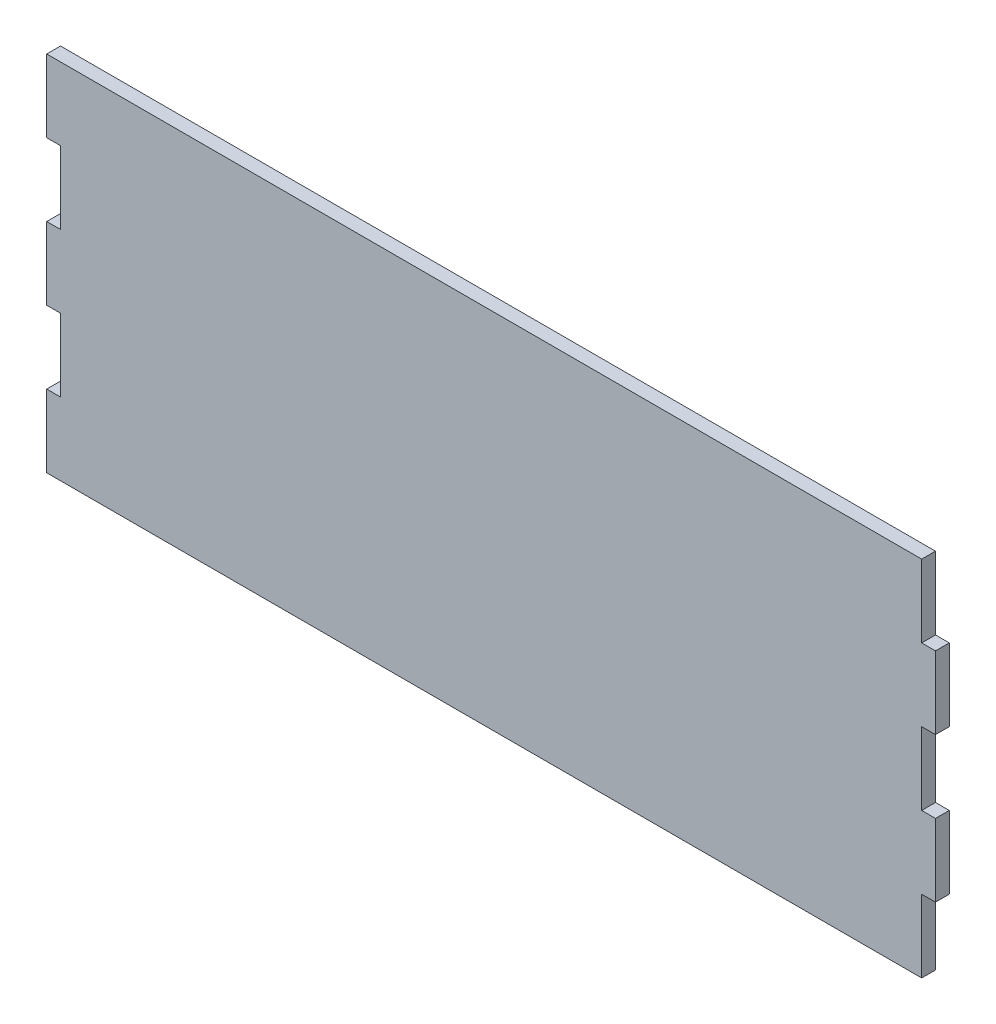
ISO-10303-21;
HEADER;
FILE_DESCRIPTION(('STEP AP214'),'2;1');
FILE_NAME('part.step','',(''),(''),'','','');
FILE_SCHEMA(('AUTOMOTIVE_DESIGN { 1 0 10303 214 1 1 1 1 }'));
ENDSEC;
DATA;
#1=APPLICATION_CONTEXT('core data for automotive mechanical design processes');
#2=APPLICATION_PROTOCOL_DEFINITION('international standard','automotive_design',2000,#1);
#3=PRODUCT_CONTEXT('',#1,'mechanical');
#4=PRODUCT('Part','Part','',(#3));
#5=PRODUCT_RELATED_PRODUCT_CATEGORY('part','',(#4));
#6=PRODUCT_DEFINITION_FORMATION('','',#4);
#7=PRODUCT_DEFINITION_CONTEXT('part definition',#1,'design');
#8=PRODUCT_DEFINITION('design','',#6,#7);
#9=PRODUCT_DEFINITION_SHAPE('','',#8);
#10=(LENGTH_UNIT() NAMED_UNIT(*) SI_UNIT(.MILLI.,.METRE.));
#11=(NAMED_UNIT(*) PLANE_ANGLE_UNIT() SI_UNIT($,.RADIAN.));
#12=(NAMED_UNIT(*) SI_UNIT($,.STERADIAN.) SOLID_ANGLE_UNIT());
#13=UNCERTAINTY_MEASURE_WITH_UNIT(LENGTH_MEASURE(1.E-05),#10,'distance_accuracy_value','');
#14=(GEOMETRIC_REPRESENTATION_CONTEXT(3) GLOBAL_UNCERTAINTY_ASSIGNED_CONTEXT((#13)) GLOBAL_UNIT_ASSIGNED_CONTEXT((#10,
#11,#12)) REPRESENTATION_CONTEXT('',''));
#15=CARTESIAN_POINT('',(0.,0.,0.));
#16=DIRECTION('',(0.,0.,1.));
#17=DIRECTION('',(1.,0.,0.));
#18=AXIS2_PLACEMENT_3D('',#15,#16,#17);
#19=CARTESIAN_POINT('',(311.15,127.,4.826));
#20=DIRECTION('',(1.,0.,0.));
#21=DIRECTION('',(0.,0.,-1.));
#22=AXIS2_PLACEMENT_3D('',#19,#20,#21);
#23=PLANE('',#22);
#24=DIRECTION('',(0.,-1.,0.));
#25=VECTOR('',#24,1.);
#26=CARTESIAN_POINT('',(311.15,127.,0.));
#27=LINE('',#26,#25);
#28=CARTESIAN_POINT('',(311.15,127.,0.));
#29=VERTEX_POINT('',#28);
#30=CARTESIAN_POINT('',(311.15,101.6,0.));
#31=VERTEX_POINT('',#30);
#32=EDGE_CURVE('E201',#29,#31,#27,.T.);
#33=ORIENTED_EDGE('',*,*,#32,.T.);
#34=DIRECTION('',(0.,0.,-1.));
#35=VECTOR('',#34,1.);
#36=CARTESIAN_POINT('',(311.15,101.6,4.826));
#37=LINE('',#36,#35);
#38=CARTESIAN_POINT('',(311.15,101.6,4.826));
#39=VERTEX_POINT('',#38);
#40=EDGE_CURVE('E11',#39,#31,#37,.T.);
#41=ORIENTED_EDGE('',*,*,#40,.F.);
#42=DIRECTION('',(0.,-1.,0.));
#43=VECTOR('',#42,1.);
#44=CARTESIAN_POINT('',(311.15,127.,4.826));
#45=LINE('',#44,#43);
#46=CARTESIAN_POINT('',(311.15,127.,4.826));
#47=VERTEX_POINT('',#46);
#48=EDGE_CURVE('E239',#47,#39,#45,.T.);
#49=ORIENTED_EDGE('',*,*,#48,.F.);
#50=DIRECTION('',(0.,0.,-1.));
#51=VECTOR('',#50,1.);
#52=CARTESIAN_POINT('',(311.15,127.,4.826));
#53=LINE('',#52,#51);
#54=EDGE_CURVE('E197',#47,#29,#53,.T.);
#55=ORIENTED_EDGE('',*,*,#54,.T.);
#56=EDGE_LOOP('',(#33,#41,#49,#55));
#57=FACE_BOUND('',#56,.T.);
#58=ADVANCED_FACE('F33',(#57),#23,.F.);
#59=CARTESIAN_POINT('',(311.15,101.6,4.826));
#60=DIRECTION('',(0.,1.,0.));
#61=DIRECTION('',(0.,0.,1.));
#62=AXIS2_PLACEMENT_3D('',#59,#60,#61);
#63=PLANE('',#62);
#64=DIRECTION('',(1.,0.,0.));
#65=VECTOR('',#64,1.);
#66=CARTESIAN_POINT('',(311.15,101.6,0.));
#67=LINE('',#66,#65);
#68=CARTESIAN_POINT('',(315.976,101.6,0.));
#69=VERTEX_POINT('',#68);
#70=EDGE_CURVE('E204',#31,#69,#67,.T.);
#71=ORIENTED_EDGE('',*,*,#70,.T.);
#72=DIRECTION('',(0.,0.,-1.));
#73=VECTOR('',#72,1.);
#74=CARTESIAN_POINT('',(315.976,101.6,4.826));
#75=LINE('',#74,#73);
#76=CARTESIAN_POINT('',(315.976,101.6,4.826));
#77=VERTEX_POINT('',#76);
#78=EDGE_CURVE('E41',#77,#69,#75,.T.);
#79=ORIENTED_EDGE('',*,*,#78,.F.);
#80=DIRECTION('',(1.,0.,0.));
#81=VECTOR('',#80,1.);
#82=CARTESIAN_POINT('',(311.15,101.6,4.826));
#83=LINE('',#82,#81);
#84=EDGE_CURVE('E128',#39,#77,#83,.T.);
#85=ORIENTED_EDGE('',*,*,#84,.F.);
#86=ORIENTED_EDGE('',*,*,#40,.T.);
#87=EDGE_LOOP('',(#71,#79,#85,#86));
#88=FACE_BOUND('',#87,.T.);
#89=ADVANCED_FACE('F357',(#88),#63,.F.);
#90=CARTESIAN_POINT('',(315.976,101.6,4.826));
#91=DIRECTION('',(1.,0.,0.));
#92=DIRECTION('',(0.,0.,-1.));
#93=AXIS2_PLACEMENT_3D('',#90,#91,#92);
#94=PLANE('',#93);
#95=DIRECTION('',(0.,-1.,0.));
#96=VECTOR('',#95,1.);
#97=CARTESIAN_POINT('',(315.976,101.6,0.));
#98=LINE('',#97,#96);
#99=CARTESIAN_POINT('',(315.976,76.2,0.));
#100=VERTEX_POINT('',#99);
#101=EDGE_CURVE('E206',#69,#100,#98,.T.);
#102=ORIENTED_EDGE('',*,*,#101,.T.);
#103=DIRECTION('',(0.,0.,-1.));
#104=VECTOR('',#103,1.);
#105=CARTESIAN_POINT('',(315.976,76.2,4.826));
#106=LINE('',#105,#104);
#107=CARTESIAN_POINT('',(315.976,76.2,4.826));
#108=VERTEX_POINT('',#107);
#109=EDGE_CURVE('E282',#108,#100,#106,.T.);
#110=ORIENTED_EDGE('',*,*,#109,.F.);
#111=DIRECTION('',(0.,-1.,0.));
#112=VECTOR('',#111,1.);
#113=CARTESIAN_POINT('',(315.976,101.6,4.826));
#114=LINE('',#113,#112);
#115=EDGE_CURVE('E290',#77,#108,#114,.T.);
#116=ORIENTED_EDGE('',*,*,#115,.F.);
#117=ORIENTED_EDGE('',*,*,#78,.T.);
#118=EDGE_LOOP('',(#102,#110,#116,#117));
#119=FACE_BOUND('',#118,.T.);
#120=ADVANCED_FACE('F288',(#119),#94,.F.);
#121=CARTESIAN_POINT('',(311.15,76.2,4.826));
#122=DIRECTION('',(0.,-1.,0.));
#123=DIRECTION('',(1.,0.,0.));
#124=AXIS2_PLACEMENT_3D('',#121,#122,#123);
#125=PLANE('',#124);
#126=DIRECTION('',(-1.,0.,0.));
#127=VECTOR('',#126,1.);
#128=CARTESIAN_POINT('',(311.15,76.2,0.));
#129=LINE('',#128,#127);
#130=CARTESIAN_POINT('',(311.15,76.2,0.));
#131=VERTEX_POINT('',#130);
#132=EDGE_CURVE('E208',#100,#131,#129,.T.);
#133=ORIENTED_EDGE('',*,*,#132,.T.);
#134=DIRECTION('',(0.,0.,-1.));
#135=VECTOR('',#134,1.);
#136=CARTESIAN_POINT('',(311.15,76.2,4.826));
#137=LINE('',#136,#135);
#138=CARTESIAN_POINT('',(311.15,76.2,4.826));
#139=VERTEX_POINT('',#138);
#140=EDGE_CURVE('E279',#139,#131,#137,.T.);
#141=ORIENTED_EDGE('',*,*,#140,.F.);
#142=DIRECTION('',(-1.,0.,0.));
#143=VECTOR('',#142,1.);
#144=CARTESIAN_POINT('',(311.15,76.2,4.826));
#145=LINE('',#144,#143);
#146=EDGE_CURVE('E308',#108,#139,#145,.T.);
#147=ORIENTED_EDGE('',*,*,#146,.F.);
#148=ORIENTED_EDGE('',*,*,#109,.T.);
#149=EDGE_LOOP('',(#133,#141,#147,#148));
#150=FACE_BOUND('',#149,.T.);
#151=ADVANCED_FACE('F299',(#150),#125,.F.);
#152=CARTESIAN_POINT('',(311.15,76.2,4.826));
#153=DIRECTION('',(1.,0.,0.));
#154=DIRECTION('',(0.,0.,-1.));
#155=AXIS2_PLACEMENT_3D('',#152,#153,#154);
#156=PLANE('',#155);
#157=DIRECTION('',(0.,-1.,0.));
#158=VECTOR('',#157,1.);
#159=CARTESIAN_POINT('',(311.15,76.2,0.));
#160=LINE('',#159,#158);
#161=CARTESIAN_POINT('',(311.15,50.8,0.));
#162=VERTEX_POINT('',#161);
#163=EDGE_CURVE('E210',#131,#162,#160,.T.);
#164=ORIENTED_EDGE('',*,*,#163,.T.);
#165=DIRECTION('',(0.,0.,-1.));
#166=VECTOR('',#165,1.);
#167=CARTESIAN_POINT('',(311.15,50.8,4.826));
#168=LINE('',#167,#166);
#169=CARTESIAN_POINT('',(311.15,50.8,4.826));
#170=VERTEX_POINT('',#169);
#171=EDGE_CURVE('E276',#170,#162,#168,.T.);
#172=ORIENTED_EDGE('',*,*,#171,.F.);
#173=DIRECTION('',(0.,-1.,0.));
#174=VECTOR('',#173,1.);
#175=CARTESIAN_POINT('',(311.15,76.2,4.826));
#176=LINE('',#175,#174);
#177=EDGE_CURVE('E305',#139,#170,#176,.T.);
#178=ORIENTED_EDGE('',*,*,#177,.F.);
#179=ORIENTED_EDGE('',*,*,#140,.T.);
#180=EDGE_LOOP('',(#164,#172,#178,#179));
#181=FACE_BOUND('',#180,.T.);
#182=ADVANCED_FACE('F303',(#181),#156,.F.);
#183=CARTESIAN_POINT('',(311.15,50.8,4.826));
#184=DIRECTION('',(0.,1.,0.));
#185=DIRECTION('',(0.,0.,1.));
#186=AXIS2_PLACEMENT_3D('',#183,#184,#185);
#187=PLANE('',#186);
#188=DIRECTION('',(1.,0.,0.));
#189=VECTOR('',#188,1.);
#190=CARTESIAN_POINT('',(311.15,50.8,0.));
#191=LINE('',#190,#189);
#192=CARTESIAN_POINT('',(315.976,50.8,0.));
#193=VERTEX_POINT('',#192);
#194=EDGE_CURVE('E212',#162,#193,#191,.T.);
#195=ORIENTED_EDGE('',*,*,#194,.T.);
#196=DIRECTION('',(0.,0.,-1.));
#197=VECTOR('',#196,1.);
#198=CARTESIAN_POINT('',(315.976,50.8,4.826));
#199=LINE('',#198,#197);
#200=CARTESIAN_POINT('',(315.976,50.8,4.826));
#201=VERTEX_POINT('',#200);
#202=EDGE_CURVE('E273',#201,#193,#199,.T.);
#203=ORIENTED_EDGE('',*,*,#202,.F.);
#204=DIRECTION('',(1.,0.,0.));
#205=VECTOR('',#204,1.);
#206=CARTESIAN_POINT('',(311.15,50.8,4.826));
#207=LINE('',#206,#205);
#208=EDGE_CURVE('E307',#170,#201,#207,.T.);
#209=ORIENTED_EDGE('',*,*,#208,.F.);
#210=ORIENTED_EDGE('',*,*,#171,.T.);
#211=EDGE_LOOP('',(#195,#203,#209,#210));
#212=FACE_BOUND('',#211,.T.);
#213=ADVANCED_FACE('F370',(#212),#187,.F.);
#214=CARTESIAN_POINT('',(315.976,50.8,4.826));
#215=DIRECTION('',(1.,0.,0.));
#216=DIRECTION('',(0.,0.,-1.));
#217=AXIS2_PLACEMENT_3D('',#214,#215,#216);
#218=PLANE('',#217);
#219=DIRECTION('',(0.,-1.,0.));
#220=VECTOR('',#219,1.);
#221=CARTESIAN_POINT('',(315.976,50.8,0.));
#222=LINE('',#221,#220);
#223=CARTESIAN_POINT('',(315.976,25.4,0.));
#224=VERTEX_POINT('',#223);
#225=EDGE_CURVE('E214',#193,#224,#222,.T.);
#226=ORIENTED_EDGE('',*,*,#225,.T.);
#227=DIRECTION('',(0.,0.,-1.));
#228=VECTOR('',#227,1.);
#229=CARTESIAN_POINT('',(315.976,25.4,4.826));
#230=LINE('',#229,#228);
#231=CARTESIAN_POINT('',(315.976,25.4,4.826));
#232=VERTEX_POINT('',#231);
#233=EDGE_CURVE('E270',#232,#224,#230,.T.);
#234=ORIENTED_EDGE('',*,*,#233,.F.);
#235=DIRECTION('',(0.,-1.,0.));
#236=VECTOR('',#235,1.);
#237=CARTESIAN_POINT('',(315.976,50.8,4.826));
#238=LINE('',#237,#236);
#239=EDGE_CURVE('E310',#201,#232,#238,.T.);
#240=ORIENTED_EDGE('',*,*,#239,.F.);
#241=ORIENTED_EDGE('',*,*,#202,.T.);
#242=EDGE_LOOP('',(#226,#234,#240,#241));
#243=FACE_BOUND('',#242,.T.);
#244=ADVANCED_FACE('F373',(#243),#218,.F.);
#245=CARTESIAN_POINT('',(311.15,25.4,4.826));
#246=DIRECTION('',(0.,-1.,0.));
#247=DIRECTION('',(1.,0.,0.));
#248=AXIS2_PLACEMENT_3D('',#245,#246,#247);
#249=PLANE('',#248);
#250=DIRECTION('',(-1.,0.,0.));
#251=VECTOR('',#250,1.);
#252=CARTESIAN_POINT('',(311.15,25.4,0.));
#253=LINE('',#252,#251);
#254=CARTESIAN_POINT('',(311.15,25.4,0.));
#255=VERTEX_POINT('',#254);
#256=EDGE_CURVE('E216',#224,#255,#253,.T.);
#257=ORIENTED_EDGE('',*,*,#256,.T.);
#258=DIRECTION('',(0.,0.,-1.));
#259=VECTOR('',#258,1.);
#260=CARTESIAN_POINT('',(311.15,25.4,4.826));
#261=LINE('',#260,#259);
#262=CARTESIAN_POINT('',(311.15,25.4,4.826));
#263=VERTEX_POINT('',#262);
#264=EDGE_CURVE('E267',#263,#255,#261,.T.);
#265=ORIENTED_EDGE('',*,*,#264,.F.);
#266=DIRECTION('',(-1.,0.,0.));
#267=VECTOR('',#266,1.);
#268=CARTESIAN_POINT('',(311.15,25.4,4.826));
#269=LINE('',#268,#267);
#270=EDGE_CURVE('E316',#232,#263,#269,.T.);
#271=ORIENTED_EDGE('',*,*,#270,.F.);
#272=ORIENTED_EDGE('',*,*,#233,.T.);
#273=EDGE_LOOP('',(#257,#265,#271,#272));
#274=FACE_BOUND('',#273,.T.);
#275=ADVANCED_FACE('F377',(#274),#249,.F.);
#276=CARTESIAN_POINT('',(311.15,25.4,4.826));
#277=DIRECTION('',(1.,0.,0.));
#278=DIRECTION('',(0.,0.,-1.));
#279=AXIS2_PLACEMENT_3D('',#276,#277,#278);
#280=PLANE('',#279);
#281=DIRECTION('',(0.,-1.,0.));
#282=VECTOR('',#281,1.);
#283=CARTESIAN_POINT('',(311.15,25.4,0.));
#284=LINE('',#283,#282);
#285=CARTESIAN_POINT('',(311.15,0.,0.));
#286=VERTEX_POINT('',#285);
#287=EDGE_CURVE('E218',#255,#286,#284,.T.);
#288=ORIENTED_EDGE('',*,*,#287,.T.);
#289=DIRECTION('',(0.,0.,-1.));
#290=VECTOR('',#289,1.);
#291=CARTESIAN_POINT('',(311.15,0.,4.826));
#292=LINE('',#291,#290);
#293=CARTESIAN_POINT('',(311.15,0.,4.826));
#294=VERTEX_POINT('',#293);
#295=EDGE_CURVE('E264',#294,#286,#292,.T.);
#296=ORIENTED_EDGE('',*,*,#295,.F.);
#297=DIRECTION('',(0.,-1.,0.));
#298=VECTOR('',#297,1.);
#299=CARTESIAN_POINT('',(311.15,25.4,4.826));
#300=LINE('',#299,#298);
#301=EDGE_CURVE('E318',#263,#294,#300,.T.);
#302=ORIENTED_EDGE('',*,*,#301,.F.);
#303=ORIENTED_EDGE('',*,*,#264,.T.);
#304=EDGE_LOOP('',(#288,#296,#302,#303));
#305=FACE_BOUND('',#304,.T.);
#306=ADVANCED_FACE('F381',(#305),#280,.F.);
#307=CARTESIAN_POINT('',(311.15,0.,4.826));
#308=DIRECTION('',(0.,1.,0.));
#309=DIRECTION('',(0.,0.,1.));
#310=AXIS2_PLACEMENT_3D('',#307,#308,#309);
#311=PLANE('',#310);
#312=DIRECTION('',(1.,0.,0.));
#313=VECTOR('',#312,1.);
#314=CARTESIAN_POINT('',(311.15,0.,0.));
#315=LINE('',#314,#313);
#316=CARTESIAN_POINT('',(617.474,0.,0.));
#317=VERTEX_POINT('',#316);
#318=EDGE_CURVE('E220',#286,#317,#315,.T.);
#319=ORIENTED_EDGE('',*,*,#318,.T.);
#320=DIRECTION('',(0.,0.,-1.));
#321=VECTOR('',#320,1.);
#322=CARTESIAN_POINT('',(617.474,0.,4.826));
#323=LINE('',#322,#321);
#324=CARTESIAN_POINT('',(617.474,0.,4.826));
#325=VERTEX_POINT('',#324);
#326=EDGE_CURVE('E261',#325,#317,#323,.T.);
#327=ORIENTED_EDGE('',*,*,#326,.F.);
#328=DIRECTION('',(1.,0.,0.));
#329=VECTOR('',#328,1.);
#330=CARTESIAN_POINT('',(311.15,0.,4.826));
#331=LINE('',#330,#329);
#332=EDGE_CURVE('E320',#294,#325,#331,.T.);
#333=ORIENTED_EDGE('',*,*,#332,.F.);
#334=ORIENTED_EDGE('',*,*,#295,.T.);
#335=EDGE_LOOP('',(#319,#327,#333,#334));
#336=FACE_BOUND('',#335,.T.);
#337=ADVANCED_FACE('F385',(#336),#311,.F.);
#338=CARTESIAN_POINT('',(617.474,25.4,4.826));
#339=DIRECTION('',(-1.,0.,0.));
#340=DIRECTION('',(0.,0.,1.));
#341=AXIS2_PLACEMENT_3D('',#338,#339,#340);
#342=PLANE('',#341);
#343=DIRECTION('',(0.,1.,0.));
#344=VECTOR('',#343,1.);
#345=CARTESIAN_POINT('',(617.474,25.4,0.));
#346=LINE('',#345,#344);
#347=CARTESIAN_POINT('',(617.474,25.4,0.));
#348=VERTEX_POINT('',#347);
#349=EDGE_CURVE('E222',#317,#348,#346,.T.);
#350=ORIENTED_EDGE('',*,*,#349,.T.);
#351=DIRECTION('',(0.,0.,-1.));
#352=VECTOR('',#351,1.);
#353=CARTESIAN_POINT('',(617.474,25.4,4.826));
#354=LINE('',#353,#352);
#355=CARTESIAN_POINT('',(617.474,25.4,4.826));
#356=VERTEX_POINT('',#355);
#357=EDGE_CURVE('E258',#356,#348,#354,.T.);
#358=ORIENTED_EDGE('',*,*,#357,.F.);
#359=DIRECTION('',(0.,1.,0.));
#360=VECTOR('',#359,1.);
#361=CARTESIAN_POINT('',(617.474,25.4,4.826));
#362=LINE('',#361,#360);
#363=EDGE_CURVE('E322',#325,#356,#362,.T.);
#364=ORIENTED_EDGE('',*,*,#363,.F.);
#365=ORIENTED_EDGE('',*,*,#326,.T.);
#366=EDGE_LOOP('',(#350,#358,#364,#365));
#367=FACE_BOUND('',#366,.T.);
#368=ADVANCED_FACE('F389',(#367),#342,.F.);
#369=CARTESIAN_POINT('',(622.3,25.4,4.826));
#370=DIRECTION('',(0.,1.,0.));
#371=DIRECTION('',(-1.,0.,0.));
#372=AXIS2_PLACEMENT_3D('',#369,#370,#371);
#373=PLANE('',#372);
#374=DIRECTION('',(1.,0.,0.));
#375=VECTOR('',#374,1.);
#376=CARTESIAN_POINT('',(622.3,25.4,0.));
#377=LINE('',#376,#375);
#378=CARTESIAN_POINT('',(622.3,25.4,0.));
#379=VERTEX_POINT('',#378);
#380=EDGE_CURVE('E224',#348,#379,#377,.T.);
#381=ORIENTED_EDGE('',*,*,#380,.T.);
#382=DIRECTION('',(0.,0.,-1.));
#383=VECTOR('',#382,1.);
#384=CARTESIAN_POINT('',(622.3,25.4,4.826));
#385=LINE('',#384,#383);
#386=CARTESIAN_POINT('',(622.3,25.4,4.826));
#387=VERTEX_POINT('',#386);
#388=EDGE_CURVE('E255',#387,#379,#385,.T.);
#389=ORIENTED_EDGE('',*,*,#388,.F.);
#390=DIRECTION('',(1.,0.,0.));
#391=VECTOR('',#390,1.);
#392=CARTESIAN_POINT('',(622.3,25.4,4.826));
#393=LINE('',#392,#391);
#394=EDGE_CURVE('E324',#356,#387,#393,.T.);
#395=ORIENTED_EDGE('',*,*,#394,.F.);
#396=ORIENTED_EDGE('',*,*,#357,.T.);
#397=EDGE_LOOP('',(#381,#389,#395,#396));
#398=FACE_BOUND('',#397,.T.);
#399=ADVANCED_FACE('F393',(#398),#373,.F.);
#400=CARTESIAN_POINT('',(622.3,50.8,4.826));
#401=DIRECTION('',(-1.,0.,0.));
#402=DIRECTION('',(0.,0.,1.));
#403=AXIS2_PLACEMENT_3D('',#400,#401,#402);
#404=PLANE('',#403);
#405=DIRECTION('',(0.,1.,0.));
#406=VECTOR('',#405,1.);
#407=CARTESIAN_POINT('',(622.3,50.8,0.));
#408=LINE('',#407,#406);
#409=CARTESIAN_POINT('',(622.3,50.8,0.));
#410=VERTEX_POINT('',#409);
#411=EDGE_CURVE('E226',#379,#410,#408,.T.);
#412=ORIENTED_EDGE('',*,*,#411,.T.);
#413=DIRECTION('',(0.,0.,-1.));
#414=VECTOR('',#413,1.);
#415=CARTESIAN_POINT('',(622.3,50.8,4.826));
#416=LINE('',#415,#414);
#417=CARTESIAN_POINT('',(622.3,50.8,4.826));
#418=VERTEX_POINT('',#417);
#419=EDGE_CURVE('E252',#418,#410,#416,.T.);
#420=ORIENTED_EDGE('',*,*,#419,.F.);
#421=DIRECTION('',(0.,1.,0.));
#422=VECTOR('',#421,1.);
#423=CARTESIAN_POINT('',(622.3,50.8,4.826));
#424=LINE('',#423,#422);
#425=EDGE_CURVE('E326',#387,#418,#424,.T.);
#426=ORIENTED_EDGE('',*,*,#425,.F.);
#427=ORIENTED_EDGE('',*,*,#388,.T.);
#428=EDGE_LOOP('',(#412,#420,#426,#427));
#429=FACE_BOUND('',#428,.T.);
#430=ADVANCED_FACE('F397',(#429),#404,.F.);
#431=CARTESIAN_POINT('',(622.3,50.8,4.826));
#432=DIRECTION('',(0.,-1.,0.));
#433=DIRECTION('',(1.,0.,0.));
#434=AXIS2_PLACEMENT_3D('',#431,#432,#433);
#435=PLANE('',#434);
#436=DIRECTION('',(-1.,0.,0.));
#437=VECTOR('',#436,1.);
#438=CARTESIAN_POINT('',(622.3,50.8,0.));
#439=LINE('',#438,#437);
#440=CARTESIAN_POINT('',(617.474,50.8,0.));
#441=VERTEX_POINT('',#440);
#442=EDGE_CURVE('E228',#410,#441,#439,.T.);
#443=ORIENTED_EDGE('',*,*,#442,.T.);
#444=DIRECTION('',(0.,0.,-1.));
#445=VECTOR('',#444,1.);
#446=CARTESIAN_POINT('',(617.474,50.8,4.826));
#447=LINE('',#446,#445);
#448=CARTESIAN_POINT('',(617.474,50.8,4.826));
#449=VERTEX_POINT('',#448);
#450=EDGE_CURVE('E249',#449,#441,#447,.T.);
#451=ORIENTED_EDGE('',*,*,#450,.F.);
#452=DIRECTION('',(-1.,0.,0.));
#453=VECTOR('',#452,1.);
#454=CARTESIAN_POINT('',(622.3,50.8,4.826));
#455=LINE('',#454,#453);
#456=EDGE_CURVE('E328',#418,#449,#455,.T.);
#457=ORIENTED_EDGE('',*,*,#456,.F.);
#458=ORIENTED_EDGE('',*,*,#419,.T.);
#459=EDGE_LOOP('',(#443,#451,#457,#458));
#460=FACE_BOUND('',#459,.T.);
#461=ADVANCED_FACE('F401',(#460),#435,.F.);
#462=CARTESIAN_POINT('',(617.474,76.2,4.826));
#463=DIRECTION('',(-1.,0.,0.));
#464=DIRECTION('',(0.,0.,1.));
#465=AXIS2_PLACEMENT_3D('',#462,#463,#464);
#466=PLANE('',#465);
#467=DIRECTION('',(0.,1.,0.));
#468=VECTOR('',#467,1.);
#469=CARTESIAN_POINT('',(617.474,76.2,0.));
#470=LINE('',#469,#468);
#471=CARTESIAN_POINT('',(617.474,76.2,0.));
#472=VERTEX_POINT('',#471);
#473=EDGE_CURVE('E230',#441,#472,#470,.T.);
#474=ORIENTED_EDGE('',*,*,#473,.T.);
#475=DIRECTION('',(0.,0.,-1.));
#476=VECTOR('',#475,1.);
#477=CARTESIAN_POINT('',(617.474,76.2,4.826));
#478=LINE('',#477,#476);
#479=CARTESIAN_POINT('',(617.474,76.2,4.826));
#480=VERTEX_POINT('',#479);
#481=EDGE_CURVE('E246',#480,#472,#478,.T.);
#482=ORIENTED_EDGE('',*,*,#481,.F.);
#483=DIRECTION('',(0.,1.,0.));
#484=VECTOR('',#483,1.);
#485=CARTESIAN_POINT('',(617.474,76.2,4.826));
#486=LINE('',#485,#484);
#487=EDGE_CURVE('E330',#449,#480,#486,.T.);
#488=ORIENTED_EDGE('',*,*,#487,.F.);
#489=ORIENTED_EDGE('',*,*,#450,.T.);
#490=EDGE_LOOP('',(#474,#482,#488,#489));
#491=FACE_BOUND('',#490,.T.);
#492=ADVANCED_FACE('F405',(#491),#466,.F.);
#493=CARTESIAN_POINT('',(617.474,76.2,4.826));
#494=DIRECTION('',(0.,1.,0.));
#495=DIRECTION('',(-1.,0.,0.));
#496=AXIS2_PLACEMENT_3D('',#493,#494,#495);
#497=PLANE('',#496);
#498=DIRECTION('',(1.,0.,0.));
#499=VECTOR('',#498,1.);
#500=CARTESIAN_POINT('',(617.474,76.2,0.));
#501=LINE('',#500,#499);
#502=CARTESIAN_POINT('',(622.3,76.2,0.));
#503=VERTEX_POINT('',#502);
#504=EDGE_CURVE('E232',#472,#503,#501,.T.);
#505=ORIENTED_EDGE('',*,*,#504,.T.);
#506=DIRECTION('',(0.,0.,-1.));
#507=VECTOR('',#506,1.);
#508=CARTESIAN_POINT('',(622.3,76.2,4.826));
#509=LINE('',#508,#507);
#510=CARTESIAN_POINT('',(622.3,76.2,4.826));
#511=VERTEX_POINT('',#510);
#512=EDGE_CURVE('E243',#511,#503,#509,.T.);
#513=ORIENTED_EDGE('',*,*,#512,.F.);
#514=DIRECTION('',(1.,0.,0.));
#515=VECTOR('',#514,1.);
#516=CARTESIAN_POINT('',(617.474,76.2,4.826));
#517=LINE('',#516,#515);
#518=EDGE_CURVE('E332',#480,#511,#517,.T.);
#519=ORIENTED_EDGE('',*,*,#518,.F.);
#520=ORIENTED_EDGE('',*,*,#481,.T.);
#521=EDGE_LOOP('',(#505,#513,#519,#520));
#522=FACE_BOUND('',#521,.T.);
#523=ADVANCED_FACE('F338',(#522),#497,.F.);
#524=CARTESIAN_POINT('',(622.3,101.6,4.826));
#525=DIRECTION('',(-1.,0.,0.));
#526=DIRECTION('',(0.,0.,1.));
#527=AXIS2_PLACEMENT_3D('',#524,#525,#526);
#528=PLANE('',#527);
#529=DIRECTION('',(0.,1.,0.));
#530=VECTOR('',#529,1.);
#531=CARTESIAN_POINT('',(622.3,101.6,0.));
#532=LINE('',#531,#530);
#533=CARTESIAN_POINT('',(622.3,101.6,0.));
#534=VERTEX_POINT('',#533);
#535=EDGE_CURVE('E234',#503,#534,#532,.T.);
#536=ORIENTED_EDGE('',*,*,#535,.T.);
#537=DIRECTION('',(0.,0.,-1.));
#538=VECTOR('',#537,1.);
#539=CARTESIAN_POINT('',(622.3,101.6,4.826));
#540=LINE('',#539,#538);
#541=CARTESIAN_POINT('',(622.3,101.6,4.826));
#542=VERTEX_POINT('',#541);
#543=EDGE_CURVE('E192',#542,#534,#540,.T.);
#544=ORIENTED_EDGE('',*,*,#543,.F.);
#545=DIRECTION('',(0.,1.,0.));
#546=VECTOR('',#545,1.);
#547=CARTESIAN_POINT('',(622.3,101.6,4.826));
#548=LINE('',#547,#546);
#549=EDGE_CURVE('E183',#511,#542,#548,.T.);
#550=ORIENTED_EDGE('',*,*,#549,.F.);
#551=ORIENTED_EDGE('',*,*,#512,.T.);
#552=EDGE_LOOP('',(#536,#544,#550,#551));
#553=FACE_BOUND('',#552,.T.);
#554=ADVANCED_FACE('F342',(#553),#528,.F.);
#555=CARTESIAN_POINT('',(617.474,101.6,4.826));
#556=DIRECTION('',(0.,-1.,0.));
#557=DIRECTION('',(1.,0.,0.));
#558=AXIS2_PLACEMENT_3D('',#555,#556,#557);
#559=PLANE('',#558);
#560=DIRECTION('',(-1.,0.,0.));
#561=VECTOR('',#560,1.);
#562=CARTESIAN_POINT('',(617.474,101.6,0.));
#563=LINE('',#562,#561);
#564=CARTESIAN_POINT('',(617.474,101.6,0.));
#565=VERTEX_POINT('',#564);
#566=EDGE_CURVE('E191',#534,#565,#563,.T.);
#567=ORIENTED_EDGE('',*,*,#566,.T.);
#568=DIRECTION('',(0.,0.,-1.));
#569=VECTOR('',#568,1.);
#570=CARTESIAN_POINT('',(617.474,101.6,4.826));
#571=LINE('',#570,#569);
#572=CARTESIAN_POINT('',(617.474,101.6,4.826));
#573=VERTEX_POINT('',#572);
#574=EDGE_CURVE('E188',#573,#565,#571,.T.);
#575=ORIENTED_EDGE('',*,*,#574,.F.);
#576=DIRECTION('',(-1.,0.,0.));
#577=VECTOR('',#576,1.);
#578=CARTESIAN_POINT('',(617.474,101.6,4.826));
#579=LINE('',#578,#577);
#580=EDGE_CURVE('E177',#542,#573,#579,.T.);
#581=ORIENTED_EDGE('',*,*,#580,.F.);
#582=ORIENTED_EDGE('',*,*,#543,.T.);
#583=EDGE_LOOP('',(#567,#575,#581,#582));
#584=FACE_BOUND('',#583,.T.);
#585=ADVANCED_FACE('F189',(#584),#559,.F.);
#586=CARTESIAN_POINT('',(617.474,127.,4.826));
#587=DIRECTION('',(-1.,0.,0.));
#588=DIRECTION('',(0.,0.,1.));
#589=AXIS2_PLACEMENT_3D('',#586,#587,#588);
#590=PLANE('',#589);
#591=DIRECTION('',(0.,1.,0.));
#592=VECTOR('',#591,1.);
#593=CARTESIAN_POINT('',(617.474,127.,0.));
#594=LINE('',#593,#592);
#595=CARTESIAN_POINT('',(617.474,127.,0.));
#596=VERTEX_POINT('',#595);
#597=EDGE_CURVE('E114',#565,#596,#594,.T.);
#598=ORIENTED_EDGE('',*,*,#597,.T.);
#599=DIRECTION('',(0.,0.,-1.));
#600=VECTOR('',#599,1.);
#601=CARTESIAN_POINT('',(617.474,127.,4.826));
#602=LINE('',#601,#600);
#603=CARTESIAN_POINT('',(617.474,127.,4.826));
#604=VERTEX_POINT('',#603);
#605=EDGE_CURVE('E193',#604,#596,#602,.T.);
#606=ORIENTED_EDGE('',*,*,#605,.F.);
#607=DIRECTION('',(0.,1.,0.));
#608=VECTOR('',#607,1.);
#609=CARTESIAN_POINT('',(617.474,127.,4.826));
#610=LINE('',#609,#608);
#611=EDGE_CURVE('E181',#573,#604,#610,.T.);
#612=ORIENTED_EDGE('',*,*,#611,.F.);
#613=ORIENTED_EDGE('',*,*,#574,.T.);
#614=EDGE_LOOP('',(#598,#606,#612,#613));
#615=FACE_BOUND('',#614,.T.);
#616=ADVANCED_FACE('F195',(#615),#590,.F.);
#617=CARTESIAN_POINT('',(311.15,127.,4.826));
#618=DIRECTION('',(0.,-1.,0.));
#619=DIRECTION('',(0.,0.,-1.));
#620=AXIS2_PLACEMENT_3D('',#617,#618,#619);
#621=PLANE('',#620);
#622=DIRECTION('',(-1.,0.,0.));
#623=VECTOR('',#622,1.);
#624=CARTESIAN_POINT('',(311.15,127.,0.));
#625=LINE('',#624,#623);
#626=EDGE_CURVE('E120',#596,#29,#625,.T.);
#627=ORIENTED_EDGE('',*,*,#626,.T.);
#628=ORIENTED_EDGE('',*,*,#54,.F.);
#629=DIRECTION('',(-1.,0.,0.));
#630=VECTOR('',#629,1.);
#631=CARTESIAN_POINT('',(311.15,127.,4.826));
#632=LINE('',#631,#630);
#633=EDGE_CURVE('E49',#604,#47,#632,.T.);
#634=ORIENTED_EDGE('',*,*,#633,.F.);
#635=ORIENTED_EDGE('',*,*,#605,.T.);
#636=EDGE_LOOP('',(#627,#628,#634,#635));
#637=FACE_BOUND('',#636,.T.);
#638=ADVANCED_FACE('F346',(#637),#621,.F.);
#639=CARTESIAN_POINT('',(0.,0.,4.826));
#640=DIRECTION('',(0.,0.,1.));
#641=DIRECTION('',(1.,0.,0.));
#642=AXIS2_PLACEMENT_3D('',#639,#640,#641);
#643=PLANE('',#642);
#644=ORIENTED_EDGE('',*,*,#48,.T.);
#645=ORIENTED_EDGE('',*,*,#84,.T.);
#646=ORIENTED_EDGE('',*,*,#115,.T.);
#647=ORIENTED_EDGE('',*,*,#146,.T.);
#648=ORIENTED_EDGE('',*,*,#177,.T.);
#649=ORIENTED_EDGE('',*,*,#208,.T.);
#650=ORIENTED_EDGE('',*,*,#239,.T.);
#651=ORIENTED_EDGE('',*,*,#270,.T.);
#652=ORIENTED_EDGE('',*,*,#301,.T.);
#653=ORIENTED_EDGE('',*,*,#332,.T.);
#654=ORIENTED_EDGE('',*,*,#363,.T.);
#655=ORIENTED_EDGE('',*,*,#394,.T.);
#656=ORIENTED_EDGE('',*,*,#425,.T.);
#657=ORIENTED_EDGE('',*,*,#456,.T.);
#658=ORIENTED_EDGE('',*,*,#487,.T.);
#659=ORIENTED_EDGE('',*,*,#518,.T.);
#660=ORIENTED_EDGE('',*,*,#549,.T.);
#661=ORIENTED_EDGE('',*,*,#580,.T.);
#662=ORIENTED_EDGE('',*,*,#611,.T.);
#663=ORIENTED_EDGE('',*,*,#633,.T.);
#664=EDGE_LOOP('',(#644,#645,#646,#647,#648,#649,#650,#651,#652,#653,#654,#655,#656,#657,#658,
#659,#660,#661,#662,#663));
#665=FACE_BOUND('',#664,.T.);
#666=ADVANCED_FACE('F179',(#665),#643,.T.);
#667=CARTESIAN_POINT('',(0.,0.,0.));
#668=DIRECTION('',(0.,0.,1.));
#669=DIRECTION('',(1.,0.,0.));
#670=AXIS2_PLACEMENT_3D('',#667,#668,#669);
#671=PLANE('',#670);
#672=ORIENTED_EDGE('',*,*,#32,.F.);
#673=ORIENTED_EDGE('',*,*,#626,.F.);
#674=ORIENTED_EDGE('',*,*,#597,.F.);
#675=ORIENTED_EDGE('',*,*,#566,.F.);
#676=ORIENTED_EDGE('',*,*,#535,.F.);
#677=ORIENTED_EDGE('',*,*,#504,.F.);
#678=ORIENTED_EDGE('',*,*,#473,.F.);
#679=ORIENTED_EDGE('',*,*,#442,.F.);
#680=ORIENTED_EDGE('',*,*,#411,.F.);
#681=ORIENTED_EDGE('',*,*,#380,.F.);
#682=ORIENTED_EDGE('',*,*,#349,.F.);
#683=ORIENTED_EDGE('',*,*,#318,.F.);
#684=ORIENTED_EDGE('',*,*,#287,.F.);
#685=ORIENTED_EDGE('',*,*,#256,.F.);
#686=ORIENTED_EDGE('',*,*,#225,.F.);
#687=ORIENTED_EDGE('',*,*,#194,.F.);
#688=ORIENTED_EDGE('',*,*,#163,.F.);
#689=ORIENTED_EDGE('',*,*,#132,.F.);
#690=ORIENTED_EDGE('',*,*,#101,.F.);
#691=ORIENTED_EDGE('',*,*,#70,.F.);
#692=EDGE_LOOP('',(#672,#673,#674,#675,#676,#677,#678,#679,#680,#681,#682,#683,#684,#685,#686,
#687,#688,#689,#690,#691));
#693=FACE_BOUND('',#692,.T.);
#694=ADVANCED_FACE('F294',(#693),#671,.F.);
#695=CLOSED_SHELL('',(#58,#89,#120,#151,#182,#213,#244,#275,#306,#337,#368,#399,#430,#461,#492,
#523,#554,#585,#616,#638,#666,#694));
#696=MANIFOLD_SOLID_BREP('B2',#695);
#697=ADVANCED_BREP_SHAPE_REPRESENTATION('',(#18,#696),#14);
#698=SHAPE_DEFINITION_REPRESENTATION(#9,#697);
ENDSEC;
END-ISO-10303-21;
